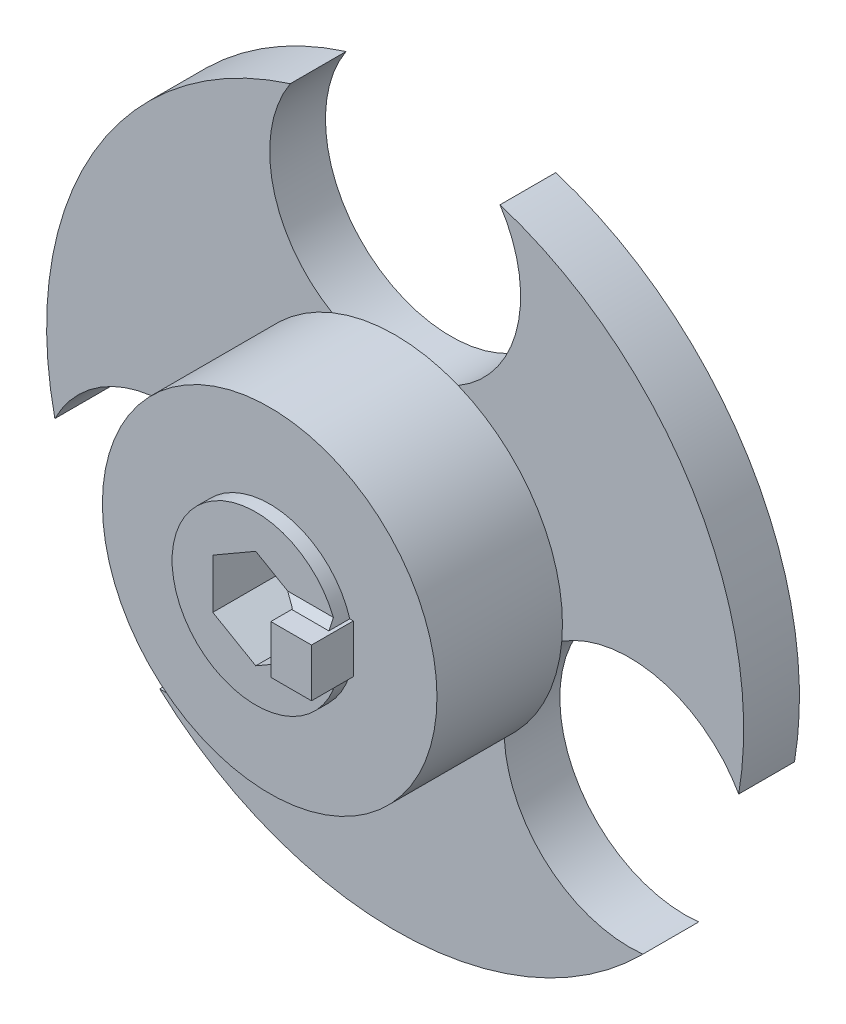
ISO-10303-21;
HEADER;
FILE_DESCRIPTION(('STEP AP214'),'2;1');
FILE_NAME('part.step','',(''),(''),'','','');
FILE_SCHEMA(('AUTOMOTIVE_DESIGN { 1 0 10303 214 1 1 1 1 }'));
ENDSEC;
DATA;
#1=APPLICATION_CONTEXT('core data for automotive mechanical design processes');
#2=APPLICATION_PROTOCOL_DEFINITION('international standard','automotive_design',2000,#1);
#3=PRODUCT_CONTEXT('',#1,'mechanical');
#4=PRODUCT('Part','Part','',(#3));
#5=PRODUCT_RELATED_PRODUCT_CATEGORY('part','',(#4));
#6=PRODUCT_DEFINITION_FORMATION('','',#4);
#7=PRODUCT_DEFINITION_CONTEXT('part definition',#1,'design');
#8=PRODUCT_DEFINITION('design','',#6,#7);
#9=PRODUCT_DEFINITION_SHAPE('','',#8);
#10=(LENGTH_UNIT() NAMED_UNIT(*) SI_UNIT(.MILLI.,.METRE.));
#11=(NAMED_UNIT(*) PLANE_ANGLE_UNIT() SI_UNIT($,.RADIAN.));
#12=(NAMED_UNIT(*) SI_UNIT($,.STERADIAN.) SOLID_ANGLE_UNIT());
#13=UNCERTAINTY_MEASURE_WITH_UNIT(LENGTH_MEASURE(1.E-05),#10,'distance_accuracy_value','');
#14=(GEOMETRIC_REPRESENTATION_CONTEXT(3) GLOBAL_UNCERTAINTY_ASSIGNED_CONTEXT((#13)) GLOBAL_UNIT_ASSIGNED_CONTEXT((#10,
#11,#12)) REPRESENTATION_CONTEXT('',''));
#15=CARTESIAN_POINT('',(0.,0.,0.));
#16=DIRECTION('',(0.,0.,1.));
#17=DIRECTION('',(1.,0.,0.));
#18=AXIS2_PLACEMENT_3D('',#15,#16,#17);
#19=CARTESIAN_POINT('',(0.,0.,-14.));
#20=DIRECTION('',(0.,0.,1.));
#21=DIRECTION('',(1.,0.,0.));
#22=AXIS2_PLACEMENT_3D('',#19,#20,#21);
#23=CYLINDRICAL_SURFACE('',#22,25.);
#24=CARTESIAN_POINT('',(0.,0.,-10.));
#25=DIRECTION('',(0.,0.,-1.));
#26=DIRECTION('',(-1.,0.,0.));
#27=AXIS2_PLACEMENT_3D('',#24,#25,#26);
#28=CIRCLE('',#27,25.);
#29=CARTESIAN_POINT('',(-24.4083995032669,-5.40648071197158,-10.));
#30=VERTEX_POINT('',#29);
#31=CARTESIAN_POINT('',(-7.52205010999547,23.8415343915344,-10.));
#32=VERTEX_POINT('',#31);
#33=EDGE_CURVE('E237',#30,#32,#28,.T.);
#34=ORIENTED_EDGE('',*,*,#33,.T.);
#35=DIRECTION('',(0.,0.,-1.));
#36=VECTOR('',#35,1.);
#37=CARTESIAN_POINT('',(-7.52205010999547,23.8415343915344,-12.));
#38=LINE('',#37,#36);
#39=CARTESIAN_POINT('',(-7.52205010999547,23.8415343915344,-14.));
#40=VERTEX_POINT('',#39);
#41=EDGE_CURVE('E71',#32,#40,#38,.T.);
#42=ORIENTED_EDGE('',*,*,#41,.T.);
#43=CARTESIAN_POINT('',(0.,0.,-14.));
#44=DIRECTION('',(0.,0.,-1.));
#45=DIRECTION('',(-1.,0.,0.));
#46=AXIS2_PLACEMENT_3D('',#43,#44,#45);
#47=CIRCLE('',#46,25.);
#48=CARTESIAN_POINT('',(-24.4083995032669,-5.40648071197158,-14.));
#49=VERTEX_POINT('',#48);
#50=EDGE_CURVE('E407',#49,#40,#47,.T.);
#51=ORIENTED_EDGE('',*,*,#50,.F.);
#52=DIRECTION('',(0.,0.,-1.));
#53=VECTOR('',#52,1.);
#54=CARTESIAN_POINT('',(-24.4083995032669,-5.40648071197158,-12.));
#55=LINE('',#54,#53);
#56=EDGE_CURVE('E402',#49,#30,#55,.F.);
#57=ORIENTED_EDGE('',*,*,#56,.T.);
#58=EDGE_LOOP('',(#34,#42,#51,#57));
#59=FACE_BOUND('',#58,.T.);
#60=ADVANCED_FACE('F48',(#59),#23,.T.);
#61=CARTESIAN_POINT('',(17.7703315833893,-17.5845191977602,-10.));
#62=VERTEX_POINT('',#61);
#63=CARTESIAN_POINT('',(-16.8863493932714,-18.4350536795628,-10.));
#64=VERTEX_POINT('',#63);
#65=EDGE_CURVE('E403',#62,#64,#28,.T.);
#66=ORIENTED_EDGE('',*,*,#65,.T.);
#67=DIRECTION('',(0.,0.,-1.));
#68=VECTOR('',#67,1.);
#69=CARTESIAN_POINT('',(-16.8863493932714,-18.4350536795628,-12.));
#70=LINE('',#69,#68);
#71=CARTESIAN_POINT('',(-16.8863493932714,-18.4350536795628,-14.));
#72=VERTEX_POINT('',#71);
#73=EDGE_CURVE('E63',#64,#72,#70,.T.);
#74=ORIENTED_EDGE('',*,*,#73,.T.);
#75=CARTESIAN_POINT('',(17.7703315833893,-17.5845191977602,-14.));
#76=VERTEX_POINT('',#75);
#77=EDGE_CURVE('E410',#76,#72,#47,.T.);
#78=ORIENTED_EDGE('',*,*,#77,.F.);
#79=DIRECTION('',(0.,0.,-1.));
#80=VECTOR('',#79,1.);
#81=CARTESIAN_POINT('',(17.7703315833893,-17.5845191977602,-12.));
#82=LINE('',#81,#80);
#83=EDGE_CURVE('E220',#76,#62,#82,.F.);
#84=ORIENTED_EDGE('',*,*,#83,.T.);
#85=EDGE_LOOP('',(#66,#74,#78,#84));
#86=FACE_BOUND('',#85,.T.);
#87=ADVANCED_FACE('F427',(#86),#23,.T.);
#88=CARTESIAN_POINT('',(0.,0.,-10.));
#89=DIRECTION('',(0.,0.,-1.));
#90=DIRECTION('',(-1.,0.,0.));
#91=AXIS2_PLACEMENT_3D('',#88,#89,#90);
#92=PLANE('',#91);
#93=CARTESIAN_POINT('',(7.52205010999547,23.8415343915344,-10.));
#94=VERTEX_POINT('',#93);
#95=CARTESIAN_POINT('',(24.6442239558718,-4.20264507338363,-10.));
#96=VERTEX_POINT('',#95);
#97=EDGE_CURVE('E404',#94,#96,#28,.T.);
#98=ORIENTED_EDGE('',*,*,#97,.F.);
#99=CARTESIAN_POINT('',(0.,18.9,-10.));
#100=DIRECTION('',(0.,0.,-1.));
#101=DIRECTION('',(-1.,0.,0.));
#102=AXIS2_PLACEMENT_3D('',#99,#100,#101);
#103=CIRCLE('',#102,9.);
#104=CARTESIAN_POINT('',(4.51881867551932,11.1166666666667,-10.));
#105=VERTEX_POINT('',#104);
#106=EDGE_CURVE('E12',#94,#105,#103,.T.);
#107=ORIENTED_EDGE('',*,*,#106,.T.);
#108=CARTESIAN_POINT('',(0.,0.,-10.));
#109=DIRECTION('',(0.,0.,-1.));
#110=DIRECTION('',(-1.,0.,0.));
#111=AXIS2_PLACEMENT_3D('',#108,#109,#110);
#112=CIRCLE('',#111,12.);
#113=CARTESIAN_POINT('',(11.9531048459326,-1.05985118867801,-10.));
#114=VERTEX_POINT('',#113);
#115=EDGE_CURVE('E226',#105,#114,#112,.T.);
#116=ORIENTED_EDGE('',*,*,#115,.T.);
#117=CARTESIAN_POINT('',(16.8117346502807,-8.63571525981212,-10.));
#118=DIRECTION('',(0.,0.,-1.));
#119=DIRECTION('',(-1.,0.,0.));
#120=AXIS2_PLACEMENT_3D('',#117,#118,#119);
#121=CIRCLE('',#120,9.);
#122=EDGE_CURVE('E209',#114,#96,#121,.T.);
#123=ORIENTED_EDGE('',*,*,#122,.T.);
#124=EDGE_LOOP('',(#98,#107,#116,#123));
#125=FACE_BOUND('',#124,.T.);
#126=ADVANCED_FACE('F231',(#125),#92,.F.);
#127=CARTESIAN_POINT('',(-11.8867250764967,-1.64492156523803,-10.));
#128=VERTEX_POINT('',#127);
#129=CARTESIAN_POINT('',(-4.51881867551932,11.1166666666667,-10.));
#130=VERTEX_POINT('',#129);
#131=EDGE_CURVE('E234',#128,#130,#112,.T.);
#132=ORIENTED_EDGE('',*,*,#131,.T.);
#133=EDGE_CURVE('E52',#130,#32,#103,.T.);
#134=ORIENTED_EDGE('',*,*,#133,.T.);
#135=ORIENTED_EDGE('',*,*,#33,.F.);
#136=CARTESIAN_POINT('',(-16.3678801315259,-9.45,-10.));
#137=DIRECTION('',(0.,0.,-1.));
#138=DIRECTION('',(-1.,0.,0.));
#139=AXIS2_PLACEMENT_3D('',#136,#137,#138);
#140=CIRCLE('',#139,9.00000000000001);
#141=EDGE_CURVE('E441',#30,#128,#140,.T.);
#142=ORIENTED_EDGE('',*,*,#141,.T.);
#143=EDGE_LOOP('',(#132,#134,#135,#142));
#144=FACE_BOUND('',#143,.T.);
#145=ADVANCED_FACE('F393',(#144),#92,.F.);
#146=CARTESIAN_POINT('',(3.08,0.,28.8811915483254));
#147=DIRECTION('',(-1.,0.,0.));
#148=DIRECTION('',(0.,0.,1.));
#149=AXIS2_PLACEMENT_3D('',#146,#147,#148);
#150=PLANE('',#149);
#151=DIRECTION('',(0.,0.707106781186548,0.707106781186548));
#152=VECTOR('',#151,1.);
#153=CARTESIAN_POINT('',(3.08,-2.23205080756887,0.));
#154=LINE('',#153,#152);
#155=CARTESIAN_POINT('',(3.08,-1.77823882910405,0.453811978464828));
#156=VERTEX_POINT('',#155);
#157=CARTESIAN_POINT('',(3.08,-1.73205080756887,0.5));
#158=VERTEX_POINT('',#157);
#159=EDGE_CURVE('E640',#156,#158,#154,.T.);
#160=ORIENTED_EDGE('',*,*,#159,.T.);
#161=DIRECTION('',(0.,0.,-1.));
#162=VECTOR('',#161,1.);
#163=CARTESIAN_POINT('',(3.08,-1.73205080756887,2.));
#164=LINE('',#163,#162);
#165=CARTESIAN_POINT('',(3.08,-1.73205080756887,2.));
#166=VERTEX_POINT('',#165);
#167=EDGE_CURVE('E286',#166,#158,#164,.T.);
#168=ORIENTED_EDGE('',*,*,#167,.F.);
#169=DIRECTION('',(0.,-1.,0.));
#170=VECTOR('',#169,1.);
#171=CARTESIAN_POINT('',(3.08,-1.73205080756887,2.));
#172=LINE('',#171,#170);
#173=CARTESIAN_POINT('',(3.08,1.73205080756887,2.));
#174=VERTEX_POINT('',#173);
#175=EDGE_CURVE('E284',#174,#166,#172,.T.);
#176=ORIENTED_EDGE('',*,*,#175,.F.);
#177=DIRECTION('',(0.,0.,-1.));
#178=VECTOR('',#177,1.);
#179=CARTESIAN_POINT('',(3.08,1.73205080756887,2.));
#180=LINE('',#179,#178);
#181=CARTESIAN_POINT('',(3.08,1.73205080756887,0.5));
#182=VERTEX_POINT('',#181);
#183=EDGE_CURVE('E288',#174,#182,#180,.T.);
#184=ORIENTED_EDGE('',*,*,#183,.T.);
#185=DIRECTION('',(0.,0.707106781186548,-0.707106781186548));
#186=VECTOR('',#185,1.);
#187=CARTESIAN_POINT('',(3.08,-13.3245703703783,15.5566211779472));
#188=LINE('',#187,#186);
#189=CARTESIAN_POINT('',(3.08,1.77823882910405,0.453811978464832));
#190=VERTEX_POINT('',#189);
#191=EDGE_CURVE('E637',#190,#182,#188,.F.);
#192=ORIENTED_EDGE('',*,*,#191,.F.);
#193=DIRECTION('',(0.,0.,-1.));
#194=VECTOR('',#193,1.);
#195=CARTESIAN_POINT('',(3.08,1.77823882910405,28.8811915483254));
#196=LINE('',#195,#194);
#197=CARTESIAN_POINT('',(3.08,1.77823882910405,-6.));
#198=VERTEX_POINT('',#197);
#199=EDGE_CURVE('E543',#190,#198,#196,.T.);
#200=ORIENTED_EDGE('',*,*,#199,.T.);
#201=DIRECTION('',(0.,1.,0.));
#202=VECTOR('',#201,1.);
#203=CARTESIAN_POINT('',(3.08,-1.77823882910405,-6.));
#204=LINE('',#203,#202);
#205=CARTESIAN_POINT('',(3.08,-1.77823882910405,-6.));
#206=VERTEX_POINT('',#205);
#207=EDGE_CURVE('E246',#206,#198,#204,.T.);
#208=ORIENTED_EDGE('',*,*,#207,.F.);
#209=DIRECTION('',(0.,0.,-1.));
#210=VECTOR('',#209,1.);
#211=CARTESIAN_POINT('',(3.08,-1.77823882910405,28.8811915483254));
#212=LINE('',#211,#210);
#213=EDGE_CURVE('E347',#156,#206,#212,.T.);
#214=ORIENTED_EDGE('',*,*,#213,.F.);
#215=EDGE_LOOP('',(#160,#168,#176,#184,#192,#200,#208,#214));
#216=FACE_BOUND('',#215,.T.);
#217=ADVANCED_FACE('F525',(#216),#150,.T.);
#218=CARTESIAN_POINT('',(4.5,-1.73205080756887,2.));
#219=DIRECTION('',(0.,1.,0.));
#220=DIRECTION('',(0.,0.,1.));
#221=AXIS2_PLACEMENT_3D('',#218,#219,#220);
#222=PLANE('',#221);
#223=DIRECTION('',(0.,0.,1.));
#224=VECTOR('',#223,1.);
#225=CARTESIAN_POINT('',(5.74456264653803,-1.73205080756887,-1.));
#226=LINE('',#225,#224);
#227=CARTESIAN_POINT('',(5.74456264653803,-1.73205080756887,-1.));
#228=VERTEX_POINT('',#227);
#229=CARTESIAN_POINT('',(5.74456264653803,-1.73205080756887,0.5));
#230=VERTEX_POINT('',#229);
#231=EDGE_CURVE('E373',#228,#230,#226,.T.);
#232=ORIENTED_EDGE('',*,*,#231,.F.);
#233=DIRECTION('',(-1.,0.,0.));
#234=VECTOR('',#233,1.);
#235=CARTESIAN_POINT('',(5.74456264653803,-1.73205080756887,-1.));
#236=LINE('',#235,#234);
#237=CARTESIAN_POINT('',(6.,-1.73205080756887,-1.));
#238=VERTEX_POINT('',#237);
#239=EDGE_CURVE('E303',#238,#228,#236,.T.);
#240=ORIENTED_EDGE('',*,*,#239,.F.);
#241=DIRECTION('',(0.,0.,-1.));
#242=VECTOR('',#241,1.);
#243=CARTESIAN_POINT('',(6.,-1.73205080756887,2.));
#244=LINE('',#243,#242);
#245=CARTESIAN_POINT('',(6.,-1.73205080756887,2.));
#246=VERTEX_POINT('',#245);
#247=EDGE_CURVE('E630',#246,#238,#244,.T.);
#248=ORIENTED_EDGE('',*,*,#247,.F.);
#249=DIRECTION('',(1.,0.,0.));
#250=VECTOR('',#249,1.);
#251=CARTESIAN_POINT('',(6.,-1.73205080756887,2.));
#252=LINE('',#251,#250);
#253=EDGE_CURVE('E270',#166,#246,#252,.T.);
#254=ORIENTED_EDGE('',*,*,#253,.F.);
#255=ORIENTED_EDGE('',*,*,#167,.T.);
#256=DIRECTION('',(1.,0.,0.));
#257=VECTOR('',#256,1.);
#258=CARTESIAN_POINT('',(4.5,-1.73205080756887,0.5));
#259=LINE('',#258,#257);
#260=EDGE_CURVE('E633',#158,#230,#259,.T.);
#261=ORIENTED_EDGE('',*,*,#260,.T.);
#262=EDGE_LOOP('',(#232,#240,#248,#254,#255,#261));
#263=FACE_BOUND('',#262,.T.);
#264=ADVANCED_FACE('F521',(#263),#222,.F.);
#265=CARTESIAN_POINT('',(6.,0.,2.));
#266=DIRECTION('',(1.,0.,0.));
#267=DIRECTION('',(0.,0.,-1.));
#268=AXIS2_PLACEMENT_3D('',#265,#266,#267);
#269=PLANE('',#268);
#270=ORIENTED_EDGE('',*,*,#247,.T.);
#271=DIRECTION('',(0.,-1.,0.));
#272=VECTOR('',#271,1.);
#273=CARTESIAN_POINT('',(6.,-1.73205080756887,-1.));
#274=LINE('',#273,#272);
#275=CARTESIAN_POINT('',(6.,1.73205080756887,-1.));
#276=VERTEX_POINT('',#275);
#277=EDGE_CURVE('E300',#276,#238,#274,.T.);
#278=ORIENTED_EDGE('',*,*,#277,.F.);
#279=DIRECTION('',(0.,0.,-1.));
#280=VECTOR('',#279,1.);
#281=CARTESIAN_POINT('',(6.,1.73205080756887,2.));
#282=LINE('',#281,#280);
#283=CARTESIAN_POINT('',(6.,1.73205080756887,2.));
#284=VERTEX_POINT('',#283);
#285=EDGE_CURVE('E313',#284,#276,#282,.T.);
#286=ORIENTED_EDGE('',*,*,#285,.F.);
#287=DIRECTION('',(0.,1.,0.));
#288=VECTOR('',#287,1.);
#289=CARTESIAN_POINT('',(6.,1.73205080756887,2.));
#290=LINE('',#289,#288);
#291=EDGE_CURVE('E279',#246,#284,#290,.T.);
#292=ORIENTED_EDGE('',*,*,#291,.F.);
#293=EDGE_LOOP('',(#270,#278,#286,#292));
#294=FACE_BOUND('',#293,.T.);
#295=ADVANCED_FACE('F517',(#294),#269,.T.);
#296=CARTESIAN_POINT('',(4.5,1.73205080756887,2.));
#297=DIRECTION('',(0.,1.,0.));
#298=DIRECTION('',(0.,0.,1.));
#299=AXIS2_PLACEMENT_3D('',#296,#297,#298);
#300=PLANE('',#299);
#301=ORIENTED_EDGE('',*,*,#285,.T.);
#302=DIRECTION('',(1.,0.,0.));
#303=VECTOR('',#302,1.);
#304=CARTESIAN_POINT('',(6.,1.73205080756887,-1.));
#305=LINE('',#304,#303);
#306=CARTESIAN_POINT('',(5.74456264653803,1.73205080756887,-1.));
#307=VERTEX_POINT('',#306);
#308=EDGE_CURVE('E297',#307,#276,#305,.T.);
#309=ORIENTED_EDGE('',*,*,#308,.F.);
#310=DIRECTION('',(0.,0.,1.));
#311=VECTOR('',#310,1.);
#312=CARTESIAN_POINT('',(5.74456264653803,1.73205080756887,-1.));
#313=LINE('',#312,#311);
#314=CARTESIAN_POINT('',(5.74456264653803,1.73205080756887,0.5));
#315=VERTEX_POINT('',#314);
#316=EDGE_CURVE('E554',#307,#315,#313,.T.);
#317=ORIENTED_EDGE('',*,*,#316,.T.);
#318=DIRECTION('',(-1.,0.,0.));
#319=VECTOR('',#318,1.);
#320=CARTESIAN_POINT('',(3.,1.73205080756887,0.5));
#321=LINE('',#320,#319);
#322=EDGE_CURVE('E306',#315,#182,#321,.T.);
#323=ORIENTED_EDGE('',*,*,#322,.T.);
#324=ORIENTED_EDGE('',*,*,#183,.F.);
#325=DIRECTION('',(-1.,0.,0.));
#326=VECTOR('',#325,1.);
#327=CARTESIAN_POINT('',(3.08,1.73205080756887,2.));
#328=LINE('',#327,#326);
#329=EDGE_CURVE('E282',#284,#174,#328,.T.);
#330=ORIENTED_EDGE('',*,*,#329,.F.);
#331=EDGE_LOOP('',(#301,#309,#317,#323,#324,#330));
#332=FACE_BOUND('',#331,.T.);
#333=ADVANCED_FACE('F514',(#332),#300,.T.);
#334=CARTESIAN_POINT('',(0.,0.,-1.));
#335=DIRECTION('',(0.,0.,1.));
#336=DIRECTION('',(1.,0.,0.));
#337=AXIS2_PLACEMENT_3D('',#334,#335,#336);
#338=CYLINDRICAL_SURFACE('',#337,6.);
#339=ORIENTED_EDGE('',*,*,#316,.F.);
#340=CARTESIAN_POINT('',(0.,0.,-1.));
#341=DIRECTION('',(0.,0.,-1.));
#342=DIRECTION('',(1.,0.,0.));
#343=AXIS2_PLACEMENT_3D('',#340,#341,#342);
#344=CIRCLE('',#343,6.);
#345=EDGE_CURVE('E294',#228,#307,#344,.T.);
#346=ORIENTED_EDGE('',*,*,#345,.F.);
#347=ORIENTED_EDGE('',*,*,#231,.T.);
#348=CARTESIAN_POINT('',(0.,0.,2.23205080756887));
#349=DIRECTION('',(0.,0.707106781186548,-0.707106781186548));
#350=DIRECTION('',(0.,0.707106781186548,0.707106781186548));
#351=AXIS2_PLACEMENT_3D('',#348,#349,#350);
#352=ELLIPSE('',#351,8.48528137423857,6.);
#353=CARTESIAN_POINT('',(5.56937601463855,-2.23205080756887,0.));
#354=VERTEX_POINT('',#353);
#355=EDGE_CURVE('E380',#230,#354,#352,.T.);
#356=ORIENTED_EDGE('',*,*,#355,.T.);
#357=CARTESIAN_POINT('',(0.,0.,0.));
#358=DIRECTION('',(0.,0.,-1.));
#359=DIRECTION('',(1.,0.,0.));
#360=AXIS2_PLACEMENT_3D('',#357,#358,#359);
#361=CIRCLE('',#360,6.);
#362=CARTESIAN_POINT('',(5.56937601463855,2.23205080756887,0.));
#363=VERTEX_POINT('',#362);
#364=EDGE_CURVE('E293',#354,#363,#361,.T.);
#365=ORIENTED_EDGE('',*,*,#364,.T.);
#366=CARTESIAN_POINT('',(0.,0.,2.23205080756888));
#367=DIRECTION('',(0.,0.707106781186548,0.707106781186548));
#368=DIRECTION('',(0.,-0.707106781186548,0.707106781186548));
#369=AXIS2_PLACEMENT_3D('',#366,#367,#368);
#370=ELLIPSE('',#369,8.48528137423857,6.);
#371=EDGE_CURVE('E551',#363,#315,#370,.F.);
#372=ORIENTED_EDGE('',*,*,#371,.T.);
#373=EDGE_LOOP('',(#339,#346,#347,#356,#365,#372));
#374=FACE_BOUND('',#373,.T.);
#375=ADVANCED_FACE('F50',(#374),#338,.T.);
#376=CARTESIAN_POINT('',(1.54,2.66735824365607,28.8811915483254));
#377=DIRECTION('',(-0.5,-0.866025403784439,0.));
#378=DIRECTION('',(0.866025403784439,-0.5,0.));
#379=AXIS2_PLACEMENT_3D('',#376,#377,#378);
#380=PLANE('',#379);
#381=DIRECTION('',(0.774596669241483,-0.447213595499958,0.447213595499958));
#382=VECTOR('',#381,1.);
#383=CARTESIAN_POINT('',(3.964,1.26786119114042,0.96418961642846));
#384=LINE('',#383,#382);
#385=CARTESIAN_POINT('',(2.29397459621557,2.23205080756887,0.));
#386=VERTEX_POINT('',#385);
#387=EDGE_CURVE('E346',#190,#386,#384,.F.);
#388=ORIENTED_EDGE('',*,*,#387,.T.);
#389=DIRECTION('',(-0.866025403784439,0.5,0.));
#390=VECTOR('',#389,1.);
#391=CARTESIAN_POINT('',(1.54,2.66735824365607,0.));
#392=LINE('',#391,#390);
#393=CARTESIAN_POINT('',(0.,3.55647765820809,0.));
#394=VERTEX_POINT('',#393);
#395=EDGE_CURVE('E379',#386,#394,#392,.T.);
#396=ORIENTED_EDGE('',*,*,#395,.T.);
#397=DIRECTION('',(0.,0.,1.));
#398=VECTOR('',#397,1.);
#399=CARTESIAN_POINT('',(0.,3.55647765820809,-6.));
#400=LINE('',#399,#398);
#401=CARTESIAN_POINT('',(0.,3.55647765820809,-6.));
#402=VERTEX_POINT('',#401);
#403=EDGE_CURVE('E273',#402,#394,#400,.T.);
#404=ORIENTED_EDGE('',*,*,#403,.F.);
#405=DIRECTION('',(-0.866025403784439,0.5,0.));
#406=VECTOR('',#405,1.);
#407=CARTESIAN_POINT('',(3.08,1.77823882910405,-6.));
#408=LINE('',#407,#406);
#409=EDGE_CURVE('E249',#198,#402,#408,.T.);
#410=ORIENTED_EDGE('',*,*,#409,.F.);
#411=ORIENTED_EDGE('',*,*,#199,.F.);
#412=EDGE_LOOP('',(#388,#396,#404,#410,#411));
#413=FACE_BOUND('',#412,.T.);
#414=ADVANCED_FACE('F531',(#413),#380,.T.);
#415=CARTESIAN_POINT('',(1.54,-2.66735824365607,28.8811915483254));
#416=DIRECTION('',(-0.5,0.866025403784439,0.));
#417=DIRECTION('',(-0.866025403784439,-0.5,0.));
#418=AXIS2_PLACEMENT_3D('',#415,#416,#417);
#419=PLANE('',#418);
#420=ORIENTED_EDGE('',*,*,#213,.T.);
#421=DIRECTION('',(0.866025403784438,0.500000000000001,0.));
#422=VECTOR('',#421,1.);
#423=CARTESIAN_POINT('',(0.,-3.55647765820809,-6.));
#424=LINE('',#423,#422);
#425=CARTESIAN_POINT('',(0.,-3.55647765820809,-6.));
#426=VERTEX_POINT('',#425);
#427=EDGE_CURVE('E242',#426,#206,#424,.T.);
#428=ORIENTED_EDGE('',*,*,#427,.F.);
#429=DIRECTION('',(0.,0.,1.));
#430=VECTOR('',#429,1.);
#431=CARTESIAN_POINT('',(0.,-3.55647765820809,-6.));
#432=LINE('',#431,#430);
#433=CARTESIAN_POINT('',(0.,-3.55647765820809,0.));
#434=VERTEX_POINT('',#433);
#435=EDGE_CURVE('E258',#426,#434,#432,.T.);
#436=ORIENTED_EDGE('',*,*,#435,.T.);
#437=DIRECTION('',(0.866025403784438,0.500000000000001,0.));
#438=VECTOR('',#437,1.);
#439=CARTESIAN_POINT('',(0.,-3.55647765820809,0.));
#440=LINE('',#439,#438);
#441=CARTESIAN_POINT('',(2.29397459621556,-2.23205080756887,0.));
#442=VERTEX_POINT('',#441);
#443=EDGE_CURVE('E261',#434,#442,#440,.T.);
#444=ORIENTED_EDGE('',*,*,#443,.T.);
#445=DIRECTION('',(0.774596669241483,0.447213595499958,0.447213595499958));
#446=VECTOR('',#445,1.);
#447=CARTESIAN_POINT('',(0.917589838486225,-3.02670691795241,-0.794656110383531));
#448=LINE('',#447,#446);
#449=EDGE_CURVE('E644',#442,#156,#448,.T.);
#450=ORIENTED_EDGE('',*,*,#449,.T.);
#451=EDGE_LOOP('',(#420,#428,#436,#444,#450));
#452=FACE_BOUND('',#451,.T.);
#453=ADVANCED_FACE('F512',(#452),#419,.T.);
#454=CARTESIAN_POINT('',(0.,-2.23205080756887,0.));
#455=DIRECTION('',(0.,0.707106781186548,-0.707106781186548));
#456=DIRECTION('',(-1.,0.,0.));
#457=AXIS2_PLACEMENT_3D('',#454,#455,#456);
#458=PLANE('',#457);
#459=ORIENTED_EDGE('',*,*,#355,.F.);
#460=ORIENTED_EDGE('',*,*,#260,.F.);
#461=ORIENTED_EDGE('',*,*,#159,.F.);
#462=ORIENTED_EDGE('',*,*,#449,.F.);
#463=DIRECTION('',(-1.,0.,0.));
#464=VECTOR('',#463,1.);
#465=CARTESIAN_POINT('',(0.,-2.23205080756887,0.));
#466=LINE('',#465,#464);
#467=EDGE_CURVE('E340',#354,#442,#466,.T.);
#468=ORIENTED_EDGE('',*,*,#467,.F.);
#469=EDGE_LOOP('',(#459,#460,#461,#462,#468));
#470=FACE_BOUND('',#469,.T.);
#471=ADVANCED_FACE('F508',(#470),#458,.F.);
#472=CARTESIAN_POINT('',(4.5,1.73205080756887,0.5));
#473=DIRECTION('',(0.,0.707106781186548,0.707106781186548));
#474=DIRECTION('',(1.,0.,0.));
#475=AXIS2_PLACEMENT_3D('',#472,#473,#474);
#476=PLANE('',#475);
#477=DIRECTION('',(1.,0.,0.));
#478=VECTOR('',#477,1.);
#479=CARTESIAN_POINT('',(5.74456264653803,2.23205080756887,0.));
#480=LINE('',#479,#478);
#481=EDGE_CURVE('E548',#386,#363,#480,.T.);
#482=ORIENTED_EDGE('',*,*,#481,.F.);
#483=ORIENTED_EDGE('',*,*,#387,.F.);
#484=ORIENTED_EDGE('',*,*,#191,.T.);
#485=ORIENTED_EDGE('',*,*,#322,.F.);
#486=ORIENTED_EDGE('',*,*,#371,.F.);
#487=EDGE_LOOP('',(#482,#483,#484,#485,#486));
#488=FACE_BOUND('',#487,.T.);
#489=ADVANCED_FACE('F504',(#488),#476,.T.);
#490=CARTESIAN_POINT('',(0.,0.,0.));
#491=DIRECTION('',(0.,0.,1.));
#492=DIRECTION('',(1.,0.,0.));
#493=AXIS2_PLACEMENT_3D('',#490,#491,#492);
#494=PLANE('',#493);
#495=ORIENTED_EDGE('',*,*,#395,.F.);
#496=ORIENTED_EDGE('',*,*,#481,.T.);
#497=ORIENTED_EDGE('',*,*,#364,.F.);
#498=ORIENTED_EDGE('',*,*,#467,.T.);
#499=ORIENTED_EDGE('',*,*,#443,.F.);
#500=DIRECTION('',(0.866025403784438,-0.500000000000001,0.));
#501=VECTOR('',#500,1.);
#502=CARTESIAN_POINT('',(-3.08,-1.77823882910405,0.));
#503=LINE('',#502,#501);
#504=CARTESIAN_POINT('',(-3.08,-1.77823882910405,0.));
#505=VERTEX_POINT('',#504);
#506=EDGE_CURVE('E233',#505,#434,#503,.T.);
#507=ORIENTED_EDGE('',*,*,#506,.F.);
#508=DIRECTION('',(0.,-1.,0.));
#509=VECTOR('',#508,1.);
#510=CARTESIAN_POINT('',(-3.08,1.77823882910405,0.));
#511=LINE('',#510,#509);
#512=CARTESIAN_POINT('',(-3.08,1.77823882910405,0.));
#513=VERTEX_POINT('',#512);
#514=EDGE_CURVE('E243',#513,#505,#511,.T.);
#515=ORIENTED_EDGE('',*,*,#514,.F.);
#516=DIRECTION('',(-0.866025403784439,-0.5,0.));
#517=VECTOR('',#516,1.);
#518=CARTESIAN_POINT('',(0.,3.55647765820809,0.));
#519=LINE('',#518,#517);
#520=EDGE_CURVE('E263',#394,#513,#519,.T.);
#521=ORIENTED_EDGE('',*,*,#520,.F.);
#522=EDGE_LOOP('',(#495,#496,#497,#498,#499,#507,#515,#521));
#523=FACE_BOUND('',#522,.T.);
#524=ADVANCED_FACE('F497',(#523),#494,.T.);
#525=CARTESIAN_POINT('',(0.,0.,-1.));
#526=DIRECTION('',(0.,0.,-1.));
#527=DIRECTION('',(-1.,0.,0.));
#528=AXIS2_PLACEMENT_3D('',#525,#526,#527);
#529=PLANE('',#528);
#530=CARTESIAN_POINT('',(0.,0.,-1.));
#531=DIRECTION('',(0.,0.,1.));
#532=DIRECTION('',(-1.,0.,0.));
#533=AXIS2_PLACEMENT_3D('',#530,#531,#532);
#534=CIRCLE('',#533,12.);
#535=CARTESIAN_POINT('',(-12.,0.,-1.));
#536=VERTEX_POINT('',#535);
#537=EDGE_CURVE('E290',#536,#536,#534,.T.);
#538=ORIENTED_EDGE('',*,*,#537,.T.);
#539=EDGE_LOOP('',(#538));
#540=FACE_BOUND('',#539,.T.);
#541=ORIENTED_EDGE('',*,*,#239,.T.);
#542=ORIENTED_EDGE('',*,*,#345,.T.);
#543=ORIENTED_EDGE('',*,*,#308,.T.);
#544=ORIENTED_EDGE('',*,*,#277,.T.);
#545=EDGE_LOOP('',(#541,#542,#543,#544));
#546=FACE_BOUND('',#545,.T.);
#547=ADVANCED_FACE('F494',(#540,#546),#529,.F.);
#548=CARTESIAN_POINT('',(0.,0.,-8.));
#549=DIRECTION('',(0.,0.,1.));
#550=DIRECTION('',(1.,0.,0.));
#551=AXIS2_PLACEMENT_3D('',#548,#549,#550);
#552=CYLINDRICAL_SURFACE('',#551,12.);
#553=ORIENTED_EDGE('',*,*,#537,.F.);
#554=EDGE_LOOP('',(#553));
#555=FACE_BOUND('',#554,.T.);
#556=EDGE_CURVE('E232',#130,#105,#112,.T.);
#557=ORIENTED_EDGE('',*,*,#556,.F.);
#558=ORIENTED_EDGE('',*,*,#131,.F.);
#559=CARTESIAN_POINT('',(-7.36790640097734,-9.47174510142863,-10.));
#560=VERTEX_POINT('',#559);
#561=EDGE_CURVE('E419',#560,#128,#112,.T.);
#562=ORIENTED_EDGE('',*,*,#561,.F.);
#563=CARTESIAN_POINT('',(7.82366237053513,-9.09891790884348,-10.));
#564=VERTEX_POINT('',#563);
#565=EDGE_CURVE('E229',#564,#560,#112,.T.);
#566=ORIENTED_EDGE('',*,*,#565,.F.);
#567=EDGE_CURVE('E206',#114,#564,#112,.T.);
#568=ORIENTED_EDGE('',*,*,#567,.F.);
#569=ORIENTED_EDGE('',*,*,#115,.F.);
#570=EDGE_LOOP('',(#557,#558,#562,#566,#568,#569));
#571=FACE_BOUND('',#570,.T.);
#572=ADVANCED_FACE('F225',(#555,#571),#552,.T.);
#573=CARTESIAN_POINT('',(0.,0.,2.));
#574=DIRECTION('',(0.,0.,-1.));
#575=DIRECTION('',(-1.,0.,0.));
#576=AXIS2_PLACEMENT_3D('',#573,#574,#575);
#577=PLANE('',#576);
#578=ORIENTED_EDGE('',*,*,#253,.T.);
#579=ORIENTED_EDGE('',*,*,#291,.T.);
#580=ORIENTED_EDGE('',*,*,#329,.T.);
#581=ORIENTED_EDGE('',*,*,#175,.T.);
#582=EDGE_LOOP('',(#578,#579,#580,#581));
#583=FACE_BOUND('',#582,.T.);
#584=ADVANCED_FACE('F489',(#583),#577,.F.);
#585=CARTESIAN_POINT('',(-3.08,-1.77823882910405,-6.));
#586=DIRECTION('',(-0.500000000000001,-0.866025403784438,0.));
#587=DIRECTION('',(0.866025403784438,-0.500000000000001,0.));
#588=AXIS2_PLACEMENT_3D('',#585,#586,#587);
#589=PLANE('',#588);
#590=ORIENTED_EDGE('',*,*,#506,.T.);
#591=ORIENTED_EDGE('',*,*,#435,.F.);
#592=DIRECTION('',(0.866025403784438,-0.500000000000001,0.));
#593=VECTOR('',#592,1.);
#594=CARTESIAN_POINT('',(-3.08,-1.77823882910405,-6.));
#595=LINE('',#594,#593);
#596=CARTESIAN_POINT('',(-3.08,-1.77823882910405,-6.));
#597=VERTEX_POINT('',#596);
#598=EDGE_CURVE('E239',#597,#426,#595,.T.);
#599=ORIENTED_EDGE('',*,*,#598,.F.);
#600=DIRECTION('',(0.,0.,1.));
#601=VECTOR('',#600,1.);
#602=CARTESIAN_POINT('',(-3.08,-1.77823882910405,-6.));
#603=LINE('',#602,#601);
#604=EDGE_CURVE('E268',#597,#505,#603,.T.);
#605=ORIENTED_EDGE('',*,*,#604,.T.);
#606=EDGE_LOOP('',(#590,#591,#599,#605));
#607=FACE_BOUND('',#606,.T.);
#608=ADVANCED_FACE('F484',(#607),#589,.F.);
#609=CARTESIAN_POINT('',(-3.08,1.77823882910405,-6.));
#610=DIRECTION('',(-1.,0.,0.));
#611=DIRECTION('',(0.,0.,1.));
#612=AXIS2_PLACEMENT_3D('',#609,#610,#611);
#613=PLANE('',#612);
#614=ORIENTED_EDGE('',*,*,#514,.T.);
#615=ORIENTED_EDGE('',*,*,#604,.F.);
#616=DIRECTION('',(0.,-1.,0.));
#617=VECTOR('',#616,1.);
#618=CARTESIAN_POINT('',(-3.08,1.77823882910405,-6.));
#619=LINE('',#618,#617);
#620=CARTESIAN_POINT('',(-3.08,1.77823882910405,-6.));
#621=VERTEX_POINT('',#620);
#622=EDGE_CURVE('E255',#621,#597,#619,.T.);
#623=ORIENTED_EDGE('',*,*,#622,.F.);
#624=DIRECTION('',(0.,0.,1.));
#625=VECTOR('',#624,1.);
#626=CARTESIAN_POINT('',(-3.08,1.77823882910405,-6.));
#627=LINE('',#626,#625);
#628=EDGE_CURVE('E271',#621,#513,#627,.T.);
#629=ORIENTED_EDGE('',*,*,#628,.T.);
#630=EDGE_LOOP('',(#614,#615,#623,#629));
#631=FACE_BOUND('',#630,.T.);
#632=ADVANCED_FACE('F479',(#631),#613,.F.);
#633=CARTESIAN_POINT('',(0.,3.55647765820809,-6.));
#634=DIRECTION('',(-0.5,0.866025403784439,0.));
#635=DIRECTION('',(-0.866025403784439,-0.5,0.));
#636=AXIS2_PLACEMENT_3D('',#633,#634,#635);
#637=PLANE('',#636);
#638=ORIENTED_EDGE('',*,*,#520,.T.);
#639=ORIENTED_EDGE('',*,*,#628,.F.);
#640=DIRECTION('',(-0.866025403784439,-0.5,0.));
#641=VECTOR('',#640,1.);
#642=CARTESIAN_POINT('',(0.,3.55647765820809,-6.));
#643=LINE('',#642,#641);
#644=EDGE_CURVE('E252',#402,#621,#643,.T.);
#645=ORIENTED_EDGE('',*,*,#644,.F.);
#646=ORIENTED_EDGE('',*,*,#403,.T.);
#647=EDGE_LOOP('',(#638,#639,#645,#646));
#648=FACE_BOUND('',#647,.T.);
#649=ADVANCED_FACE('F474',(#648),#637,.F.);
#650=CARTESIAN_POINT('',(0.,0.,-6.));
#651=DIRECTION('',(0.,0.,1.));
#652=DIRECTION('',(1.,0.,0.));
#653=AXIS2_PLACEMENT_3D('',#650,#651,#652);
#654=PLANE('',#653);
#655=ORIENTED_EDGE('',*,*,#598,.T.);
#656=ORIENTED_EDGE('',*,*,#427,.T.);
#657=ORIENTED_EDGE('',*,*,#207,.T.);
#658=ORIENTED_EDGE('',*,*,#409,.T.);
#659=ORIENTED_EDGE('',*,*,#644,.T.);
#660=ORIENTED_EDGE('',*,*,#622,.T.);
#661=EDGE_LOOP('',(#655,#656,#657,#658,#659,#660));
#662=FACE_BOUND('',#661,.T.);
#663=ADVANCED_FACE('F468',(#662),#654,.T.);
#664=CARTESIAN_POINT('',(7.52205010999547,23.8415343915344,-14.));
#665=VERTEX_POINT('',#664);
#666=CARTESIAN_POINT('',(24.6442239558718,-4.20264507338363,-14.));
#667=VERTEX_POINT('',#666);
#668=EDGE_CURVE('E411',#665,#667,#47,.T.);
#669=ORIENTED_EDGE('',*,*,#668,.F.);
#670=DIRECTION('',(0.,0.,-1.));
#671=VECTOR('',#670,1.);
#672=CARTESIAN_POINT('',(7.52205010999547,23.8415343915344,-12.));
#673=LINE('',#672,#671);
#674=EDGE_CURVE('E405',#665,#94,#673,.F.);
#675=ORIENTED_EDGE('',*,*,#674,.T.);
#676=ORIENTED_EDGE('',*,*,#97,.T.);
#677=DIRECTION('',(0.,0.,-1.));
#678=VECTOR('',#677,1.);
#679=CARTESIAN_POINT('',(24.6442239558718,-4.20264507338363,-12.));
#680=LINE('',#679,#678);
#681=EDGE_CURVE('E215',#96,#667,#680,.T.);
#682=ORIENTED_EDGE('',*,*,#681,.T.);
#683=EDGE_LOOP('',(#669,#675,#676,#682));
#684=FACE_BOUND('',#683,.T.);
#685=ADVANCED_FACE('F434',(#684),#23,.T.);
#686=CARTESIAN_POINT('',(0.,0.,-14.));
#687=DIRECTION('',(0.,0.,-1.));
#688=DIRECTION('',(-1.,0.,0.));
#689=AXIS2_PLACEMENT_3D('',#686,#687,#688);
#690=PLANE('',#689);
#691=CARTESIAN_POINT('',(0.,18.9,-14.));
#692=DIRECTION('',(0.,0.,-1.));
#693=DIRECTION('',(-1.,0.,0.));
#694=AXIS2_PLACEMENT_3D('',#691,#692,#693);
#695=CIRCLE('',#694,9.);
#696=EDGE_CURVE('E436',#665,#40,#695,.T.);
#697=ORIENTED_EDGE('',*,*,#696,.F.);
#698=ORIENTED_EDGE('',*,*,#668,.T.);
#699=CARTESIAN_POINT('',(16.8117346502807,-8.63571525981212,-14.));
#700=DIRECTION('',(0.,0.,-1.));
#701=DIRECTION('',(-1.,0.,0.));
#702=AXIS2_PLACEMENT_3D('',#699,#700,#701);
#703=CIRCLE('',#702,9.);
#704=EDGE_CURVE('E210',#76,#667,#703,.T.);
#705=ORIENTED_EDGE('',*,*,#704,.F.);
#706=ORIENTED_EDGE('',*,*,#77,.T.);
#707=CARTESIAN_POINT('',(-16.3678801315259,-9.45,-14.));
#708=DIRECTION('',(0.,0.,-1.));
#709=DIRECTION('',(-1.,0.,0.));
#710=AXIS2_PLACEMENT_3D('',#707,#708,#709);
#711=CIRCLE('',#710,9.00000000000001);
#712=EDGE_CURVE('E445',#49,#72,#711,.T.);
#713=ORIENTED_EDGE('',*,*,#712,.F.);
#714=ORIENTED_EDGE('',*,*,#50,.T.);
#715=EDGE_LOOP('',(#697,#698,#705,#706,#713,#714));
#716=FACE_BOUND('',#715,.T.);
#717=ADVANCED_FACE('F437',(#716),#690,.T.);
#718=ORIENTED_EDGE('',*,*,#565,.T.);
#719=CARTESIAN_POINT('',(-16.3678801315259,-9.45,-10.));
#720=DIRECTION('',(0.,0.,-1.));
#721=DIRECTION('',(-1.,0.,0.));
#722=AXIS2_PLACEMENT_3D('',#719,#720,#721);
#723=CIRCLE('',#722,9.00000000000001);
#724=EDGE_CURVE('E385',#560,#64,#723,.T.);
#725=ORIENTED_EDGE('',*,*,#724,.T.);
#726=ORIENTED_EDGE('',*,*,#65,.F.);
#727=CARTESIAN_POINT('',(16.8117346502807,-8.63571525981212,-10.));
#728=DIRECTION('',(0.,0.,-1.));
#729=DIRECTION('',(-1.,0.,0.));
#730=AXIS2_PLACEMENT_3D('',#727,#728,#729);
#731=CIRCLE('',#730,9.);
#732=EDGE_CURVE('E384',#62,#564,#731,.T.);
#733=ORIENTED_EDGE('',*,*,#732,.T.);
#734=EDGE_LOOP('',(#718,#725,#726,#733));
#735=FACE_BOUND('',#734,.T.);
#736=ADVANCED_FACE('F423',(#735),#92,.F.);
#737=CARTESIAN_POINT('',(16.8117346502807,-8.63571525981212,-10.));
#738=DIRECTION('',(0.,0.,-1.));
#739=DIRECTION('',(-1.,0.,0.));
#740=AXIS2_PLACEMENT_3D('',#737,#738,#739);
#741=PLANE('',#740);
#742=EDGE_CURVE('E202',#564,#114,#121,.T.);
#743=ORIENTED_EDGE('',*,*,#742,.T.);
#744=ORIENTED_EDGE('',*,*,#567,.T.);
#745=EDGE_LOOP('',(#743,#744));
#746=FACE_BOUND('',#745,.T.);
#747=ADVANCED_FACE('F204',(#746),#741,.T.);
#748=CARTESIAN_POINT('',(16.8117346502807,-8.63571525981212,-10.));
#749=DIRECTION('',(0.,0.,-1.));
#750=DIRECTION('',(-1.,0.,0.));
#751=AXIS2_PLACEMENT_3D('',#748,#749,#750);
#752=CYLINDRICAL_SURFACE('',#751,9.);
#753=ORIENTED_EDGE('',*,*,#122,.F.);
#754=ORIENTED_EDGE('',*,*,#742,.F.);
#755=ORIENTED_EDGE('',*,*,#732,.F.);
#756=ORIENTED_EDGE('',*,*,#83,.F.);
#757=ORIENTED_EDGE('',*,*,#704,.T.);
#758=ORIENTED_EDGE('',*,*,#681,.F.);
#759=EDGE_LOOP('',(#753,#754,#755,#756,#757,#758));
#760=FACE_BOUND('',#759,.T.);
#761=ADVANCED_FACE('F213',(#760),#752,.F.);
#762=CARTESIAN_POINT('',(-16.3678801315259,-9.45,-10.));
#763=DIRECTION('',(0.,0.,-1.));
#764=DIRECTION('',(-1.,0.,0.));
#765=AXIS2_PLACEMENT_3D('',#762,#763,#764);
#766=PLANE('',#765);
#767=EDGE_CURVE('E438',#128,#560,#140,.T.);
#768=ORIENTED_EDGE('',*,*,#767,.T.);
#769=ORIENTED_EDGE('',*,*,#561,.T.);
#770=EDGE_LOOP('',(#768,#769));
#771=FACE_BOUND('',#770,.T.);
#772=ADVANCED_FACE('F456',(#771),#766,.T.);
#773=CARTESIAN_POINT('',(-16.3678801315259,-9.45,-10.));
#774=DIRECTION('',(0.,0.,-1.));
#775=DIRECTION('',(-1.,0.,0.));
#776=AXIS2_PLACEMENT_3D('',#773,#774,#775);
#777=CYLINDRICAL_SURFACE('',#776,9.00000000000001);
#778=ORIENTED_EDGE('',*,*,#724,.F.);
#779=ORIENTED_EDGE('',*,*,#767,.F.);
#780=ORIENTED_EDGE('',*,*,#141,.F.);
#781=ORIENTED_EDGE('',*,*,#56,.F.);
#782=ORIENTED_EDGE('',*,*,#712,.T.);
#783=ORIENTED_EDGE('',*,*,#73,.F.);
#784=EDGE_LOOP('',(#778,#779,#780,#781,#782,#783));
#785=FACE_BOUND('',#784,.T.);
#786=ADVANCED_FACE('F446',(#785),#777,.F.);
#787=CARTESIAN_POINT('',(0.,18.9,-10.));
#788=DIRECTION('',(0.,0.,-1.));
#789=DIRECTION('',(-1.,0.,0.));
#790=AXIS2_PLACEMENT_3D('',#787,#788,#789);
#791=PLANE('',#790);
#792=CARTESIAN_POINT('',(0.,18.9,-10.));
#793=DIRECTION('',(0.,0.,-1.));
#794=DIRECTION('',(-1.,0.,0.));
#795=AXIS2_PLACEMENT_3D('',#792,#793,#794);
#796=CIRCLE('',#795,9.);
#797=EDGE_CURVE('E439',#105,#130,#796,.T.);
#798=ORIENTED_EDGE('',*,*,#797,.T.);
#799=ORIENTED_EDGE('',*,*,#556,.T.);
#800=EDGE_LOOP('',(#798,#799));
#801=FACE_BOUND('',#800,.T.);
#802=ADVANCED_FACE('F448',(#801),#791,.T.);
#803=CARTESIAN_POINT('',(0.,18.9,-10.));
#804=DIRECTION('',(0.,0.,-1.));
#805=DIRECTION('',(-1.,0.,0.));
#806=AXIS2_PLACEMENT_3D('',#803,#804,#805);
#807=CYLINDRICAL_SURFACE('',#806,9.);
#808=ORIENTED_EDGE('',*,*,#133,.F.);
#809=ORIENTED_EDGE('',*,*,#797,.F.);
#810=ORIENTED_EDGE('',*,*,#106,.F.);
#811=ORIENTED_EDGE('',*,*,#674,.F.);
#812=ORIENTED_EDGE('',*,*,#696,.T.);
#813=ORIENTED_EDGE('',*,*,#41,.F.);
#814=EDGE_LOOP('',(#808,#809,#810,#811,#812,#813));
#815=FACE_BOUND('',#814,.T.);
#816=ADVANCED_FACE('F435',(#815),#807,.F.);
#817=CLOSED_SHELL('',(#60,#87,#126,#145,#217,#264,#295,#333,#375,#414,#453,#471,#489,#524,#547,
#572,#584,#608,#632,#649,#663,#685,#717,#736,#747,#761,#772,#786,#802,#816));
#818=MANIFOLD_SOLID_BREP('B2',#817);
#819=ADVANCED_BREP_SHAPE_REPRESENTATION('',(#18,#818),#14);
#820=SHAPE_DEFINITION_REPRESENTATION(#9,#819);
ENDSEC;
END-ISO-10303-21;
